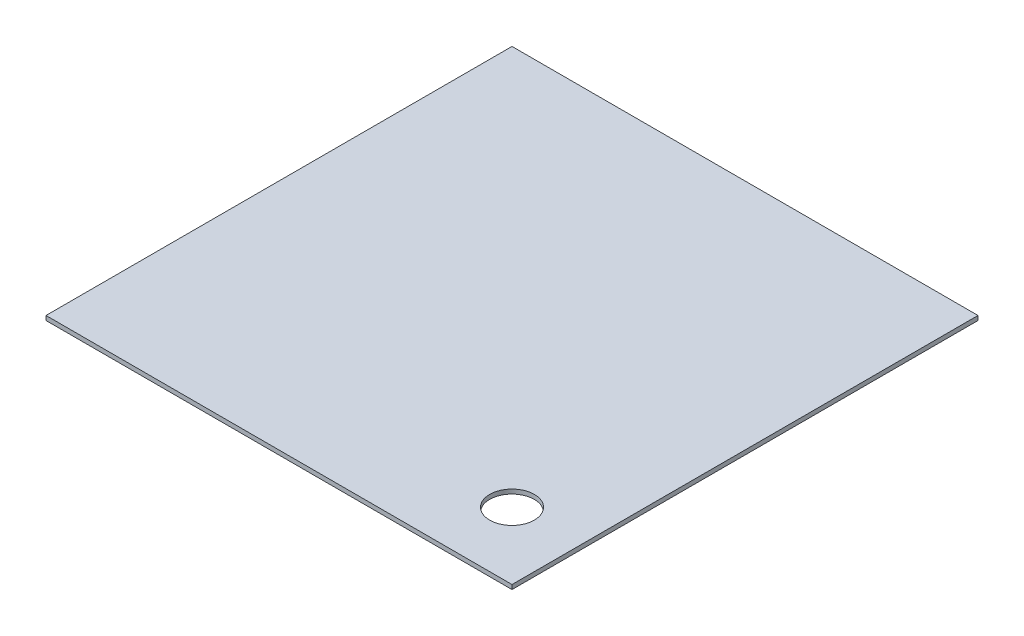
ISO-10303-21;
HEADER;
FILE_DESCRIPTION(('STEP AP214'),'2;1');
FILE_NAME('part.step','',(''),(''),'','','');
FILE_SCHEMA(('AUTOMOTIVE_DESIGN { 1 0 10303 214 1 1 1 1 }'));
ENDSEC;
DATA;
#1=APPLICATION_CONTEXT('core data for automotive mechanical design processes');
#2=APPLICATION_PROTOCOL_DEFINITION('international standard','automotive_design',2000,#1);
#3=PRODUCT_CONTEXT('',#1,'mechanical');
#4=PRODUCT('Part','Part','',(#3));
#5=PRODUCT_RELATED_PRODUCT_CATEGORY('part','',(#4));
#6=PRODUCT_DEFINITION_FORMATION('','',#4);
#7=PRODUCT_DEFINITION_CONTEXT('part definition',#1,'design');
#8=PRODUCT_DEFINITION('design','',#6,#7);
#9=PRODUCT_DEFINITION_SHAPE('','',#8);
#10=(LENGTH_UNIT() NAMED_UNIT(*) SI_UNIT(.MILLI.,.METRE.));
#11=(NAMED_UNIT(*) PLANE_ANGLE_UNIT() SI_UNIT($,.RADIAN.));
#12=(NAMED_UNIT(*) SI_UNIT($,.STERADIAN.) SOLID_ANGLE_UNIT());
#13=UNCERTAINTY_MEASURE_WITH_UNIT(LENGTH_MEASURE(1.E-05),#10,'distance_accuracy_value','');
#14=(GEOMETRIC_REPRESENTATION_CONTEXT(3) GLOBAL_UNCERTAINTY_ASSIGNED_CONTEXT((#13)) GLOBAL_UNIT_ASSIGNED_CONTEXT((#10,
#11,#12)) REPRESENTATION_CONTEXT('',''));
#15=CARTESIAN_POINT('',(0.,0.,0.));
#16=DIRECTION('',(0.,0.,1.));
#17=DIRECTION('',(1.,0.,0.));
#18=AXIS2_PLACEMENT_3D('',#15,#16,#17);
#19=CARTESIAN_POINT('',(132.6642,2.5,132.6642));
#20=DIRECTION('',(-1.,0.,0.));
#21=DIRECTION('',(0.,0.,1.));
#22=AXIS2_PLACEMENT_3D('',#19,#20,#21);
#23=PLANE('',#22);
#24=DIRECTION('',(0.,0.,-1.));
#25=VECTOR('',#24,1.);
#26=CARTESIAN_POINT('',(132.6642,0.,132.6642));
#27=LINE('',#26,#25);
#28=CARTESIAN_POINT('',(132.6642,0.,132.6642));
#29=VERTEX_POINT('',#28);
#30=CARTESIAN_POINT('',(132.6642,0.,-132.6642));
#31=VERTEX_POINT('',#30);
#32=EDGE_CURVE('E106',#29,#31,#27,.T.);
#33=ORIENTED_EDGE('',*,*,#32,.T.);
#34=DIRECTION('',(0.,-1.,0.));
#35=VECTOR('',#34,1.);
#36=CARTESIAN_POINT('',(132.6642,2.5,-132.6642));
#37=LINE('',#36,#35);
#38=CARTESIAN_POINT('',(132.6642,2.5,-132.6642));
#39=VERTEX_POINT('',#38);
#40=EDGE_CURVE('E11',#39,#31,#37,.T.);
#41=ORIENTED_EDGE('',*,*,#40,.F.);
#42=DIRECTION('',(0.,0.,-1.));
#43=VECTOR('',#42,1.);
#44=CARTESIAN_POINT('',(132.6642,2.5,132.6642));
#45=LINE('',#44,#43);
#46=CARTESIAN_POINT('',(132.6642,2.5,132.6642));
#47=VERTEX_POINT('',#46);
#48=EDGE_CURVE('E90',#47,#39,#45,.T.);
#49=ORIENTED_EDGE('',*,*,#48,.F.);
#50=DIRECTION('',(0.,-1.,0.));
#51=VECTOR('',#50,1.);
#52=CARTESIAN_POINT('',(132.6642,2.5,132.6642));
#53=LINE('',#52,#51);
#54=EDGE_CURVE('E102',#47,#29,#53,.T.);
#55=ORIENTED_EDGE('',*,*,#54,.T.);
#56=EDGE_LOOP('',(#33,#41,#49,#55));
#57=FACE_BOUND('',#56,.T.);
#58=ADVANCED_FACE('F38',(#57),#23,.F.);
#59=CARTESIAN_POINT('',(-132.6642,2.5,-132.6642));
#60=DIRECTION('',(0.,0.,1.));
#61=DIRECTION('',(1.,0.,0.));
#62=AXIS2_PLACEMENT_3D('',#59,#60,#61);
#63=PLANE('',#62);
#64=DIRECTION('',(-1.,0.,0.));
#65=VECTOR('',#64,1.);
#66=CARTESIAN_POINT('',(-132.6642,0.,-132.6642));
#67=LINE('',#66,#65);
#68=CARTESIAN_POINT('',(-132.6642,0.,-132.6642));
#69=VERTEX_POINT('',#68);
#70=EDGE_CURVE('E95',#31,#69,#67,.T.);
#71=ORIENTED_EDGE('',*,*,#70,.T.);
#72=DIRECTION('',(0.,-1.,0.));
#73=VECTOR('',#72,1.);
#74=CARTESIAN_POINT('',(-132.6642,2.5,-132.6642));
#75=LINE('',#74,#73);
#76=CARTESIAN_POINT('',(-132.6642,2.5,-132.6642));
#77=VERTEX_POINT('',#76);
#78=EDGE_CURVE('E47',#77,#69,#75,.T.);
#79=ORIENTED_EDGE('',*,*,#78,.F.);
#80=DIRECTION('',(-1.,0.,0.));
#81=VECTOR('',#80,1.);
#82=CARTESIAN_POINT('',(-132.6642,2.5,-132.6642));
#83=LINE('',#82,#81);
#84=EDGE_CURVE('E85',#39,#77,#83,.T.);
#85=ORIENTED_EDGE('',*,*,#84,.F.);
#86=ORIENTED_EDGE('',*,*,#40,.T.);
#87=EDGE_LOOP('',(#71,#79,#85,#86));
#88=FACE_BOUND('',#87,.T.);
#89=ADVANCED_FACE('F94',(#88),#63,.F.);
#90=CARTESIAN_POINT('',(-132.6642,2.5,132.6642));
#91=DIRECTION('',(1.,0.,0.));
#92=DIRECTION('',(0.,0.,-1.));
#93=AXIS2_PLACEMENT_3D('',#90,#91,#92);
#94=PLANE('',#93);
#95=DIRECTION('',(0.,0.,1.));
#96=VECTOR('',#95,1.);
#97=CARTESIAN_POINT('',(-132.6642,0.,132.6642));
#98=LINE('',#97,#96);
#99=CARTESIAN_POINT('',(-132.6642,0.,132.6642));
#100=VERTEX_POINT('',#99);
#101=EDGE_CURVE('E72',#69,#100,#98,.T.);
#102=ORIENTED_EDGE('',*,*,#101,.T.);
#103=DIRECTION('',(0.,-1.,0.));
#104=VECTOR('',#103,1.);
#105=CARTESIAN_POINT('',(-132.6642,2.5,132.6642));
#106=LINE('',#105,#104);
#107=CARTESIAN_POINT('',(-132.6642,2.5,132.6642));
#108=VERTEX_POINT('',#107);
#109=EDGE_CURVE('E97',#108,#100,#106,.T.);
#110=ORIENTED_EDGE('',*,*,#109,.F.);
#111=DIRECTION('',(0.,0.,1.));
#112=VECTOR('',#111,1.);
#113=CARTESIAN_POINT('',(-132.6642,2.5,132.6642));
#114=LINE('',#113,#112);
#115=EDGE_CURVE('E88',#77,#108,#114,.T.);
#116=ORIENTED_EDGE('',*,*,#115,.F.);
#117=ORIENTED_EDGE('',*,*,#78,.T.);
#118=EDGE_LOOP('',(#102,#110,#116,#117));
#119=FACE_BOUND('',#118,.T.);
#120=ADVANCED_FACE('F98',(#119),#94,.F.);
#121=CARTESIAN_POINT('',(-132.6642,2.5,132.6642));
#122=DIRECTION('',(0.,0.,-1.));
#123=DIRECTION('',(-1.,0.,0.));
#124=AXIS2_PLACEMENT_3D('',#121,#122,#123);
#125=PLANE('',#124);
#126=DIRECTION('',(1.,0.,0.));
#127=VECTOR('',#126,1.);
#128=CARTESIAN_POINT('',(-132.6642,0.,132.6642));
#129=LINE('',#128,#127);
#130=EDGE_CURVE('E78',#100,#29,#129,.T.);
#131=ORIENTED_EDGE('',*,*,#130,.T.);
#132=ORIENTED_EDGE('',*,*,#54,.F.);
#133=DIRECTION('',(1.,0.,0.));
#134=VECTOR('',#133,1.);
#135=CARTESIAN_POINT('',(-132.6642,2.5,132.6642));
#136=LINE('',#135,#134);
#137=EDGE_CURVE('E55',#108,#47,#136,.T.);
#138=ORIENTED_EDGE('',*,*,#137,.F.);
#139=ORIENTED_EDGE('',*,*,#109,.T.);
#140=EDGE_LOOP('',(#131,#132,#138,#139));
#141=FACE_BOUND('',#140,.T.);
#142=ADVANCED_FACE('F120',(#141),#125,.F.);
#143=CARTESIAN_POINT('',(0.,2.5,0.));
#144=DIRECTION('',(0.,-1.,0.));
#145=DIRECTION('',(0.,0.,-1.));
#146=AXIS2_PLACEMENT_3D('',#143,#144,#145);
#147=PLANE('',#146);
#148=CARTESIAN_POINT('',(94.5642,2.5,94.5642));
#149=DIRECTION('',(0.,1.,0.));
#150=DIRECTION('',(0.,0.,1.));
#151=AXIS2_PLACEMENT_3D('',#148,#149,#150);
#152=CIRCLE('',#151,12.7);
#153=CARTESIAN_POINT('',(94.5642,2.5,107.2642));
#154=VERTEX_POINT('',#153);
#155=EDGE_CURVE('E127',#154,#154,#152,.T.);
#156=ORIENTED_EDGE('',*,*,#155,.F.);
#157=EDGE_LOOP('',(#156));
#158=FACE_BOUND('',#157,.T.);
#159=ORIENTED_EDGE('',*,*,#48,.T.);
#160=ORIENTED_EDGE('',*,*,#84,.T.);
#161=ORIENTED_EDGE('',*,*,#115,.T.);
#162=ORIENTED_EDGE('',*,*,#137,.T.);
#163=EDGE_LOOP('',(#159,#160,#161,#162));
#164=FACE_BOUND('',#163,.T.);
#165=ADVANCED_FACE('F86',(#158,#164),#147,.F.);
#166=CARTESIAN_POINT('',(0.,0.,0.));
#167=DIRECTION('',(0.,-1.,0.));
#168=DIRECTION('',(0.,0.,-1.));
#169=AXIS2_PLACEMENT_3D('',#166,#167,#168);
#170=PLANE('',#169);
#171=CARTESIAN_POINT('',(94.5642,0.,94.5642));
#172=DIRECTION('',(0.,1.,0.));
#173=DIRECTION('',(0.,0.,1.));
#174=AXIS2_PLACEMENT_3D('',#171,#172,#173);
#175=CIRCLE('',#174,12.7);
#176=CARTESIAN_POINT('',(94.5642,0.,107.2642));
#177=VERTEX_POINT('',#176);
#178=EDGE_CURVE('E110',#177,#177,#175,.T.);
#179=ORIENTED_EDGE('',*,*,#178,.T.);
#180=EDGE_LOOP('',(#179));
#181=FACE_BOUND('',#180,.T.);
#182=ORIENTED_EDGE('',*,*,#32,.F.);
#183=ORIENTED_EDGE('',*,*,#130,.F.);
#184=ORIENTED_EDGE('',*,*,#101,.F.);
#185=ORIENTED_EDGE('',*,*,#70,.F.);
#186=EDGE_LOOP('',(#182,#183,#184,#185));
#187=FACE_BOUND('',#186,.T.);
#188=ADVANCED_FACE('F123',(#181,#187),#170,.T.);
#189=CARTESIAN_POINT('',(94.5642,0.,94.5642));
#190=DIRECTION('',(0.,1.,0.));
#191=DIRECTION('',(0.,0.,1.));
#192=AXIS2_PLACEMENT_3D('',#189,#190,#191);
#193=CYLINDRICAL_SURFACE('',#192,12.7);
#194=ORIENTED_EDGE('',*,*,#178,.F.);
#195=EDGE_LOOP('',(#194));
#196=FACE_BOUND('',#195,.T.);
#197=ORIENTED_EDGE('',*,*,#155,.T.);
#198=EDGE_LOOP('',(#197));
#199=FACE_BOUND('',#198,.T.);
#200=ADVANCED_FACE('F136',(#196,#199),#193,.F.);
#201=CLOSED_SHELL('',(#58,#89,#120,#142,#165,#188,#200));
#202=MANIFOLD_SOLID_BREP('B2',#201);
#203=ADVANCED_BREP_SHAPE_REPRESENTATION('',(#18,#202),#14);
#204=SHAPE_DEFINITION_REPRESENTATION(#9,#203);
ENDSEC;
END-ISO-10303-21;
